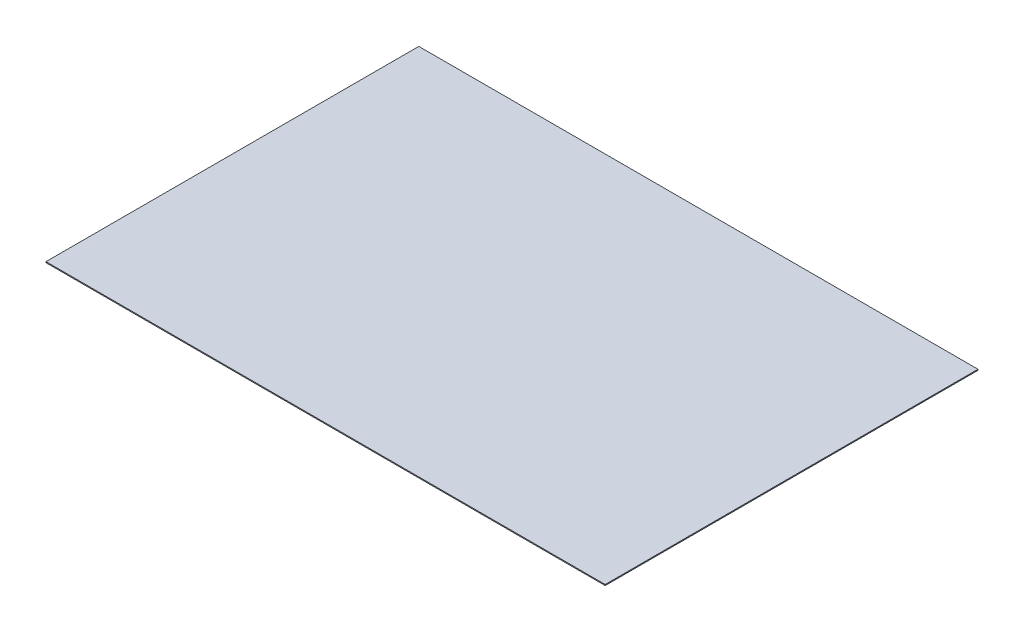
ISO-10303-21;
HEADER;
FILE_DESCRIPTION(('STEP AP214'),'2;1');
FILE_NAME('part.step','',(''),(''),'','','');
FILE_SCHEMA(('AUTOMOTIVE_DESIGN { 1 0 10303 214 1 1 1 1 }'));
ENDSEC;
DATA;
#1=APPLICATION_CONTEXT('core data for automotive mechanical design processes');
#2=APPLICATION_PROTOCOL_DEFINITION('international standard','automotive_design',2000,#1);
#3=PRODUCT_CONTEXT('',#1,'mechanical');
#4=PRODUCT('Part','Part','',(#3));
#5=PRODUCT_RELATED_PRODUCT_CATEGORY('part','',(#4));
#6=PRODUCT_DEFINITION_FORMATION('','',#4);
#7=PRODUCT_DEFINITION_CONTEXT('part definition',#1,'design');
#8=PRODUCT_DEFINITION('design','',#6,#7);
#9=PRODUCT_DEFINITION_SHAPE('','',#8);
#10=(LENGTH_UNIT() NAMED_UNIT(*) SI_UNIT(.MILLI.,.METRE.));
#11=(NAMED_UNIT(*) PLANE_ANGLE_UNIT() SI_UNIT($,.RADIAN.));
#12=(NAMED_UNIT(*) SI_UNIT($,.STERADIAN.) SOLID_ANGLE_UNIT());
#13=UNCERTAINTY_MEASURE_WITH_UNIT(LENGTH_MEASURE(1.E-05),#10,'distance_accuracy_value','');
#14=(GEOMETRIC_REPRESENTATION_CONTEXT(3) GLOBAL_UNCERTAINTY_ASSIGNED_CONTEXT((#13)) GLOBAL_UNIT_ASSIGNED_CONTEXT((#10,
#11,#12)) REPRESENTATION_CONTEXT('',''));
#15=CARTESIAN_POINT('',(0.,0.,0.));
#16=DIRECTION('',(0.,0.,1.));
#17=DIRECTION('',(1.,0.,0.));
#18=AXIS2_PLACEMENT_3D('',#15,#16,#17);
#19=CARTESIAN_POINT('',(0.,6.35,0.));
#20=DIRECTION('',(1.,0.,0.));
#21=DIRECTION('',(0.,0.,-1.));
#22=AXIS2_PLACEMENT_3D('',#19,#20,#21);
#23=PLANE('',#22);
#24=DIRECTION('',(0.,0.,1.));
#25=VECTOR('',#24,1.);
#26=CARTESIAN_POINT('',(0.,0.,0.));
#27=LINE('',#26,#25);
#28=CARTESIAN_POINT('',(0.,0.,-2438.4));
#29=VERTEX_POINT('',#28);
#30=CARTESIAN_POINT('',(0.,0.,0.));
#31=VERTEX_POINT('',#30);
#32=EDGE_CURVE('E104',#29,#31,#27,.T.);
#33=ORIENTED_EDGE('',*,*,#32,.T.);
#34=DIRECTION('',(0.,-1.,0.));
#35=VECTOR('',#34,1.);
#36=CARTESIAN_POINT('',(0.,6.35,0.));
#37=LINE('',#36,#35);
#38=CARTESIAN_POINT('',(0.,6.35,0.));
#39=VERTEX_POINT('',#38);
#40=EDGE_CURVE('E11',#39,#31,#37,.T.);
#41=ORIENTED_EDGE('',*,*,#40,.F.);
#42=DIRECTION('',(0.,0.,1.));
#43=VECTOR('',#42,1.);
#44=CARTESIAN_POINT('',(0.,6.35,0.));
#45=LINE('',#44,#43);
#46=CARTESIAN_POINT('',(0.,6.35,-2438.4));
#47=VERTEX_POINT('',#46);
#48=EDGE_CURVE('E88',#47,#39,#45,.T.);
#49=ORIENTED_EDGE('',*,*,#48,.F.);
#50=DIRECTION('',(0.,-1.,0.));
#51=VECTOR('',#50,1.);
#52=CARTESIAN_POINT('',(0.,6.35,-2438.4));
#53=LINE('',#52,#51);
#54=EDGE_CURVE('E100',#47,#29,#53,.T.);
#55=ORIENTED_EDGE('',*,*,#54,.T.);
#56=EDGE_LOOP('',(#33,#41,#49,#55));
#57=FACE_BOUND('',#56,.T.);
#58=ADVANCED_FACE('F36',(#57),#23,.F.);
#59=CARTESIAN_POINT('',(0.,6.35,0.));
#60=DIRECTION('',(0.,0.,-1.));
#61=DIRECTION('',(-1.,0.,0.));
#62=AXIS2_PLACEMENT_3D('',#59,#60,#61);
#63=PLANE('',#62);
#64=DIRECTION('',(1.,0.,0.));
#65=VECTOR('',#64,1.);
#66=CARTESIAN_POINT('',(0.,0.,0.));
#67=LINE('',#66,#65);
#68=CARTESIAN_POINT('',(3657.6,0.,0.));
#69=VERTEX_POINT('',#68);
#70=EDGE_CURVE('E93',#31,#69,#67,.T.);
#71=ORIENTED_EDGE('',*,*,#70,.T.);
#72=DIRECTION('',(0.,-1.,0.));
#73=VECTOR('',#72,1.);
#74=CARTESIAN_POINT('',(3657.6,6.35,0.));
#75=LINE('',#74,#73);
#76=CARTESIAN_POINT('',(3657.6,6.35,0.));
#77=VERTEX_POINT('',#76);
#78=EDGE_CURVE('E45',#77,#69,#75,.T.);
#79=ORIENTED_EDGE('',*,*,#78,.F.);
#80=DIRECTION('',(1.,0.,0.));
#81=VECTOR('',#80,1.);
#82=CARTESIAN_POINT('',(0.,6.35,0.));
#83=LINE('',#82,#81);
#84=EDGE_CURVE('E83',#39,#77,#83,.T.);
#85=ORIENTED_EDGE('',*,*,#84,.F.);
#86=ORIENTED_EDGE('',*,*,#40,.T.);
#87=EDGE_LOOP('',(#71,#79,#85,#86));
#88=FACE_BOUND('',#87,.T.);
#89=ADVANCED_FACE('F92',(#88),#63,.F.);
#90=CARTESIAN_POINT('',(3657.6,6.35,0.));
#91=DIRECTION('',(-1.,0.,0.));
#92=DIRECTION('',(0.,0.,1.));
#93=AXIS2_PLACEMENT_3D('',#90,#91,#92);
#94=PLANE('',#93);
#95=DIRECTION('',(0.,0.,-1.));
#96=VECTOR('',#95,1.);
#97=CARTESIAN_POINT('',(3657.6,0.,0.));
#98=LINE('',#97,#96);
#99=CARTESIAN_POINT('',(3657.6,0.,-2438.4));
#100=VERTEX_POINT('',#99);
#101=EDGE_CURVE('E70',#69,#100,#98,.T.);
#102=ORIENTED_EDGE('',*,*,#101,.T.);
#103=DIRECTION('',(0.,-1.,0.));
#104=VECTOR('',#103,1.);
#105=CARTESIAN_POINT('',(3657.6,6.35,-2438.4));
#106=LINE('',#105,#104);
#107=CARTESIAN_POINT('',(3657.6,6.35,-2438.4));
#108=VERTEX_POINT('',#107);
#109=EDGE_CURVE('E95',#108,#100,#106,.T.);
#110=ORIENTED_EDGE('',*,*,#109,.F.);
#111=DIRECTION('',(0.,0.,-1.));
#112=VECTOR('',#111,1.);
#113=CARTESIAN_POINT('',(3657.6,6.35,0.));
#114=LINE('',#113,#112);
#115=EDGE_CURVE('E86',#77,#108,#114,.T.);
#116=ORIENTED_EDGE('',*,*,#115,.F.);
#117=ORIENTED_EDGE('',*,*,#78,.T.);
#118=EDGE_LOOP('',(#102,#110,#116,#117));
#119=FACE_BOUND('',#118,.T.);
#120=ADVANCED_FACE('F96',(#119),#94,.F.);
#121=CARTESIAN_POINT('',(0.,6.35,-2438.4));
#122=DIRECTION('',(0.,0.,1.));
#123=DIRECTION('',(1.,0.,0.));
#124=AXIS2_PLACEMENT_3D('',#121,#122,#123);
#125=PLANE('',#124);
#126=DIRECTION('',(-1.,0.,0.));
#127=VECTOR('',#126,1.);
#128=CARTESIAN_POINT('',(0.,0.,-2438.4));
#129=LINE('',#128,#127);
#130=EDGE_CURVE('E76',#100,#29,#129,.T.);
#131=ORIENTED_EDGE('',*,*,#130,.T.);
#132=ORIENTED_EDGE('',*,*,#54,.F.);
#133=DIRECTION('',(-1.,0.,0.));
#134=VECTOR('',#133,1.);
#135=CARTESIAN_POINT('',(0.,6.35,-2438.4));
#136=LINE('',#135,#134);
#137=EDGE_CURVE('E53',#108,#47,#136,.T.);
#138=ORIENTED_EDGE('',*,*,#137,.F.);
#139=ORIENTED_EDGE('',*,*,#109,.T.);
#140=EDGE_LOOP('',(#131,#132,#138,#139));
#141=FACE_BOUND('',#140,.T.);
#142=ADVANCED_FACE('F117',(#141),#125,.F.);
#143=CARTESIAN_POINT('',(0.,6.35,0.));
#144=DIRECTION('',(0.,-1.,0.));
#145=DIRECTION('',(0.,0.,-1.));
#146=AXIS2_PLACEMENT_3D('',#143,#144,#145);
#147=PLANE('',#146);
#148=ORIENTED_EDGE('',*,*,#48,.T.);
#149=ORIENTED_EDGE('',*,*,#84,.T.);
#150=ORIENTED_EDGE('',*,*,#115,.T.);
#151=ORIENTED_EDGE('',*,*,#137,.T.);
#152=EDGE_LOOP('',(#148,#149,#150,#151));
#153=FACE_BOUND('',#152,.T.);
#154=ADVANCED_FACE('F84',(#153),#147,.F.);
#155=CARTESIAN_POINT('',(0.,0.,0.));
#156=DIRECTION('',(0.,-1.,0.));
#157=DIRECTION('',(0.,0.,-1.));
#158=AXIS2_PLACEMENT_3D('',#155,#156,#157);
#159=PLANE('',#158);
#160=ORIENTED_EDGE('',*,*,#32,.F.);
#161=ORIENTED_EDGE('',*,*,#130,.F.);
#162=ORIENTED_EDGE('',*,*,#101,.F.);
#163=ORIENTED_EDGE('',*,*,#70,.F.);
#164=EDGE_LOOP('',(#160,#161,#162,#163));
#165=FACE_BOUND('',#164,.T.);
#166=ADVANCED_FACE('F120',(#165),#159,.T.);
#167=CLOSED_SHELL('',(#58,#89,#120,#142,#154,#166));
#168=MANIFOLD_SOLID_BREP('B2',#167);
#169=ADVANCED_BREP_SHAPE_REPRESENTATION('',(#18,#168),#14);
#170=SHAPE_DEFINITION_REPRESENTATION(#9,#169);
ENDSEC;
END-ISO-10303-21;
